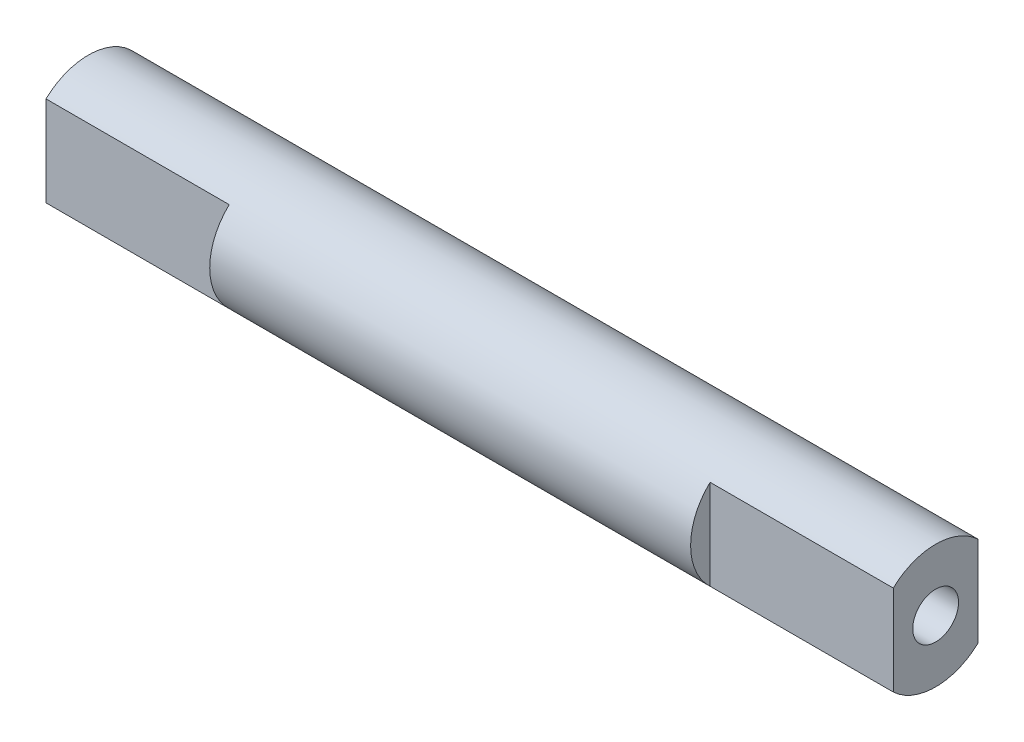
ISO-10303-21;
HEADER;
FILE_DESCRIPTION(('STEP AP214'),'2;1');
FILE_NAME('part.step','',(''),(''),'','','');
FILE_SCHEMA(('AUTOMOTIVE_DESIGN { 1 0 10303 214 1 1 1 1 }'));
ENDSEC;
DATA;
#1=APPLICATION_CONTEXT('core data for automotive mechanical design processes');
#2=APPLICATION_PROTOCOL_DEFINITION('international standard','automotive_design',2000,#1);
#3=PRODUCT_CONTEXT('',#1,'mechanical');
#4=PRODUCT('Part','Part','',(#3));
#5=PRODUCT_RELATED_PRODUCT_CATEGORY('part','',(#4));
#6=PRODUCT_DEFINITION_FORMATION('','',#4);
#7=PRODUCT_DEFINITION_CONTEXT('part definition',#1,'design');
#8=PRODUCT_DEFINITION('design','',#6,#7);
#9=PRODUCT_DEFINITION_SHAPE('','',#8);
#10=(LENGTH_UNIT() NAMED_UNIT(*) SI_UNIT(.MILLI.,.METRE.));
#11=(NAMED_UNIT(*) PLANE_ANGLE_UNIT() SI_UNIT($,.RADIAN.));
#12=(NAMED_UNIT(*) SI_UNIT($,.STERADIAN.) SOLID_ANGLE_UNIT());
#13=UNCERTAINTY_MEASURE_WITH_UNIT(LENGTH_MEASURE(1.E-05),#10,'distance_accuracy_value','');
#14=(GEOMETRIC_REPRESENTATION_CONTEXT(3) GLOBAL_UNCERTAINTY_ASSIGNED_CONTEXT((#13)) GLOBAL_UNIT_ASSIGNED_CONTEXT((#10,
#11,#12)) REPRESENTATION_CONTEXT('',''));
#15=CARTESIAN_POINT('',(0.,0.,0.));
#16=DIRECTION('',(0.,0.,1.));
#17=DIRECTION('',(1.,0.,0.));
#18=AXIS2_PLACEMENT_3D('',#15,#16,#17);
#19=CARTESIAN_POINT('',(18.5,0.,0.));
#20=DIRECTION('',(-1.,0.,0.));
#21=DIRECTION('',(0.,0.,1.));
#22=AXIS2_PLACEMENT_3D('',#19,#20,#21);
#23=CYLINDRICAL_SURFACE('',#22,2.7);
#24=CARTESIAN_POINT('',(18.5,0.,0.));
#25=DIRECTION('',(1.,0.,0.));
#26=DIRECTION('',(0.,0.,-1.));
#27=AXIS2_PLACEMENT_3D('',#24,#25,#26);
#28=CIRCLE('',#27,2.7);
#29=CARTESIAN_POINT('',(18.5,-1.96659604392971,1.85));
#30=VERTEX_POINT('',#29);
#31=CARTESIAN_POINT('',(18.5,-1.96659604392971,-1.85));
#32=VERTEX_POINT('',#31);
#33=EDGE_CURVE('E40',#30,#32,#28,.T.);
#34=ORIENTED_EDGE('',*,*,#33,.F.);
#35=DIRECTION('',(1.,0.,0.));
#36=VECTOR('',#35,1.);
#37=CARTESIAN_POINT('',(10.5,-1.96659604392971,1.85));
#38=LINE('',#37,#36);
#39=CARTESIAN_POINT('',(10.5,-1.96659604392971,1.85));
#40=VERTEX_POINT('',#39);
#41=EDGE_CURVE('E139',#40,#30,#38,.T.);
#42=ORIENTED_EDGE('',*,*,#41,.F.);
#43=CARTESIAN_POINT('',(10.5,0.,0.));
#44=DIRECTION('',(1.,0.,0.));
#45=DIRECTION('',(0.,0.,-1.));
#46=AXIS2_PLACEMENT_3D('',#43,#44,#45);
#47=CIRCLE('',#46,2.7);
#48=CARTESIAN_POINT('',(10.5,1.96659604392971,1.85));
#49=VERTEX_POINT('',#48);
#50=EDGE_CURVE('E133',#49,#40,#47,.T.);
#51=ORIENTED_EDGE('',*,*,#50,.F.);
#52=DIRECTION('',(1.,0.,0.));
#53=VECTOR('',#52,1.);
#54=CARTESIAN_POINT('',(10.5,1.96659604392971,1.85));
#55=LINE('',#54,#53);
#56=CARTESIAN_POINT('',(18.5,1.96659604392971,1.85));
#57=VERTEX_POINT('',#56);
#58=EDGE_CURVE('E142',#49,#57,#55,.T.);
#59=ORIENTED_EDGE('',*,*,#58,.T.);
#60=CARTESIAN_POINT('',(18.5,1.96659604392971,-1.85));
#61=VERTEX_POINT('',#60);
#62=EDGE_CURVE('E11',#61,#57,#28,.T.);
#63=ORIENTED_EDGE('',*,*,#62,.F.);
#64=DIRECTION('',(1.,0.,0.));
#65=VECTOR('',#64,1.);
#66=CARTESIAN_POINT('',(10.5,1.96659604392971,-1.85));
#67=LINE('',#66,#65);
#68=CARTESIAN_POINT('',(10.5,1.96659604392971,-1.85));
#69=VERTEX_POINT('',#68);
#70=EDGE_CURVE('E152',#69,#61,#67,.T.);
#71=ORIENTED_EDGE('',*,*,#70,.F.);
#72=CARTESIAN_POINT('',(10.5,0.,0.));
#73=DIRECTION('',(1.,0.,0.));
#74=DIRECTION('',(0.,0.,-1.));
#75=AXIS2_PLACEMENT_3D('',#72,#73,#74);
#76=CIRCLE('',#75,2.7);
#77=CARTESIAN_POINT('',(10.5,-1.96659604392971,-1.85));
#78=VERTEX_POINT('',#77);
#79=EDGE_CURVE('E147',#78,#69,#76,.T.);
#80=ORIENTED_EDGE('',*,*,#79,.F.);
#81=DIRECTION('',(1.,0.,0.));
#82=VECTOR('',#81,1.);
#83=CARTESIAN_POINT('',(10.5,-1.96659604392971,-1.85));
#84=LINE('',#83,#82);
#85=EDGE_CURVE('E141',#78,#32,#84,.T.);
#86=ORIENTED_EDGE('',*,*,#85,.T.);
#87=EDGE_LOOP('',(#34,#42,#51,#59,#63,#71,#80,#86));
#88=FACE_BOUND('',#87,.T.);
#89=DIRECTION('',(-1.,0.,0.));
#90=VECTOR('',#89,1.);
#91=CARTESIAN_POINT('',(-10.5,1.96659604392971,1.85));
#92=LINE('',#91,#90);
#93=CARTESIAN_POINT('',(-10.5,1.96659604392971,1.85));
#94=VERTEX_POINT('',#93);
#95=CARTESIAN_POINT('',(-18.5,1.96659604392971,1.85));
#96=VERTEX_POINT('',#95);
#97=EDGE_CURVE('E55',#94,#96,#92,.T.);
#98=ORIENTED_EDGE('',*,*,#97,.F.);
#99=CARTESIAN_POINT('',(-10.5,0.,0.));
#100=DIRECTION('',(1.,0.,0.));
#101=DIRECTION('',(0.,0.,-1.));
#102=AXIS2_PLACEMENT_3D('',#99,#100,#101);
#103=CIRCLE('',#102,2.7);
#104=CARTESIAN_POINT('',(-10.5,-1.96659604392971,1.85));
#105=VERTEX_POINT('',#104);
#106=EDGE_CURVE('E102',#94,#105,#103,.T.);
#107=ORIENTED_EDGE('',*,*,#106,.T.);
#108=DIRECTION('',(-1.,0.,0.));
#109=VECTOR('',#108,1.);
#110=CARTESIAN_POINT('',(-10.5,-1.96659604392971,1.85));
#111=LINE('',#110,#109);
#112=CARTESIAN_POINT('',(-18.5,-1.96659604392971,1.85));
#113=VERTEX_POINT('',#112);
#114=EDGE_CURVE('E99',#105,#113,#111,.T.);
#115=ORIENTED_EDGE('',*,*,#114,.T.);
#116=CARTESIAN_POINT('',(-18.5,0.,0.));
#117=DIRECTION('',(1.,0.,0.));
#118=DIRECTION('',(0.,0.,-1.));
#119=AXIS2_PLACEMENT_3D('',#116,#117,#118);
#120=CIRCLE('',#119,2.7);
#121=CARTESIAN_POINT('',(-18.5,-1.96659604392971,-1.85));
#122=VERTEX_POINT('',#121);
#123=EDGE_CURVE('E145',#113,#122,#120,.T.);
#124=ORIENTED_EDGE('',*,*,#123,.T.);
#125=DIRECTION('',(-1.,0.,0.));
#126=VECTOR('',#125,1.);
#127=CARTESIAN_POINT('',(-10.5,-1.96659604392971,-1.85));
#128=LINE('',#127,#126);
#129=CARTESIAN_POINT('',(-10.5,-1.96659604392971,-1.85));
#130=VERTEX_POINT('',#129);
#131=EDGE_CURVE('E47',#130,#122,#128,.T.);
#132=ORIENTED_EDGE('',*,*,#131,.F.);
#133=CARTESIAN_POINT('',(-10.5,0.,0.));
#134=DIRECTION('',(1.,0.,0.));
#135=DIRECTION('',(0.,0.,-1.));
#136=AXIS2_PLACEMENT_3D('',#133,#134,#135);
#137=CIRCLE('',#136,2.7);
#138=CARTESIAN_POINT('',(-10.5,1.96659604392971,-1.85));
#139=VERTEX_POINT('',#138);
#140=EDGE_CURVE('E116',#130,#139,#137,.T.);
#141=ORIENTED_EDGE('',*,*,#140,.T.);
#142=DIRECTION('',(-1.,0.,0.));
#143=VECTOR('',#142,1.);
#144=CARTESIAN_POINT('',(-10.5,1.96659604392971,-1.85));
#145=LINE('',#144,#143);
#146=CARTESIAN_POINT('',(-18.5,1.96659604392971,-1.85));
#147=VERTEX_POINT('',#146);
#148=EDGE_CURVE('E124',#139,#147,#145,.T.);
#149=ORIENTED_EDGE('',*,*,#148,.T.);
#150=EDGE_CURVE('E35',#147,#96,#120,.T.);
#151=ORIENTED_EDGE('',*,*,#150,.T.);
#152=EDGE_LOOP('',(#98,#107,#115,#124,#132,#141,#149,#151));
#153=FACE_BOUND('',#152,.T.);
#154=ADVANCED_FACE('F32',(#88,#153),#23,.T.);
#155=CARTESIAN_POINT('',(-18.5,0.,0.));
#156=DIRECTION('',(1.,0.,0.));
#157=DIRECTION('',(0.,0.,-1.));
#158=AXIS2_PLACEMENT_3D('',#155,#156,#157);
#159=PLANE('',#158);
#160=CARTESIAN_POINT('',(-18.5,0.,0.));
#161=DIRECTION('',(1.,0.,0.));
#162=DIRECTION('',(0.,0.,-1.));
#163=AXIS2_PLACEMENT_3D('',#160,#161,#162);
#164=CIRCLE('',#163,1.);
#165=CARTESIAN_POINT('',(-18.5,0.,-1.));
#166=VERTEX_POINT('',#165);
#167=EDGE_CURVE('E284',#166,#166,#164,.T.);
#168=ORIENTED_EDGE('',*,*,#167,.T.);
#169=EDGE_LOOP('',(#168));
#170=FACE_BOUND('',#169,.T.);
#171=DIRECTION('',(0.,1.,0.));
#172=VECTOR('',#171,1.);
#173=CARTESIAN_POINT('',(-18.5,1.96659604392971,1.85));
#174=LINE('',#173,#172);
#175=EDGE_CURVE('E106',#113,#96,#174,.T.);
#176=ORIENTED_EDGE('',*,*,#175,.T.);
#177=ORIENTED_EDGE('',*,*,#150,.F.);
#178=DIRECTION('',(0.,-1.,0.));
#179=VECTOR('',#178,1.);
#180=CARTESIAN_POINT('',(-18.5,1.96659604392971,-1.85));
#181=LINE('',#180,#179);
#182=EDGE_CURVE('E120',#147,#122,#181,.T.);
#183=ORIENTED_EDGE('',*,*,#182,.T.);
#184=ORIENTED_EDGE('',*,*,#123,.F.);
#185=EDGE_LOOP('',(#176,#177,#183,#184));
#186=FACE_BOUND('',#185,.T.);
#187=ADVANCED_FACE('F189',(#170,#186),#159,.F.);
#188=CARTESIAN_POINT('',(18.5,0.,0.));
#189=DIRECTION('',(1.,0.,0.));
#190=DIRECTION('',(0.,0.,-1.));
#191=AXIS2_PLACEMENT_3D('',#188,#189,#190);
#192=PLANE('',#191);
#193=CARTESIAN_POINT('',(18.5,0.,0.));
#194=DIRECTION('',(1.,0.,0.));
#195=DIRECTION('',(0.,0.,-1.));
#196=AXIS2_PLACEMENT_3D('',#193,#194,#195);
#197=CIRCLE('',#196,1.);
#198=CARTESIAN_POINT('',(18.5,0.,-1.));
#199=VERTEX_POINT('',#198);
#200=EDGE_CURVE('E112',#199,#199,#197,.T.);
#201=ORIENTED_EDGE('',*,*,#200,.F.);
#202=EDGE_LOOP('',(#201));
#203=FACE_BOUND('',#202,.T.);
#204=DIRECTION('',(0.,1.,0.));
#205=VECTOR('',#204,1.);
#206=CARTESIAN_POINT('',(18.5,1.96659604392971,1.85));
#207=LINE('',#206,#205);
#208=EDGE_CURVE('E136',#30,#57,#207,.T.);
#209=ORIENTED_EDGE('',*,*,#208,.F.);
#210=ORIENTED_EDGE('',*,*,#33,.T.);
#211=DIRECTION('',(0.,-1.,0.));
#212=VECTOR('',#211,1.);
#213=CARTESIAN_POINT('',(18.5,1.96659604392971,-1.85));
#214=LINE('',#213,#212);
#215=EDGE_CURVE('E130',#61,#32,#214,.T.);
#216=ORIENTED_EDGE('',*,*,#215,.F.);
#217=ORIENTED_EDGE('',*,*,#62,.T.);
#218=EDGE_LOOP('',(#209,#210,#216,#217));
#219=FACE_BOUND('',#218,.T.);
#220=ADVANCED_FACE('F167',(#203,#219),#192,.T.);
#221=CARTESIAN_POINT('',(10.5,1.96659604392971,-1.85));
#222=DIRECTION('',(0.,0.,1.));
#223=DIRECTION('',(1.,0.,0.));
#224=AXIS2_PLACEMENT_3D('',#221,#222,#223);
#225=PLANE('',#224);
#226=ORIENTED_EDGE('',*,*,#215,.T.);
#227=ORIENTED_EDGE('',*,*,#85,.F.);
#228=DIRECTION('',(0.,-1.,0.));
#229=VECTOR('',#228,1.);
#230=CARTESIAN_POINT('',(10.5,1.96659604392971,-1.85));
#231=LINE('',#230,#229);
#232=EDGE_CURVE('E149',#69,#78,#231,.T.);
#233=ORIENTED_EDGE('',*,*,#232,.F.);
#234=ORIENTED_EDGE('',*,*,#70,.T.);
#235=EDGE_LOOP('',(#226,#227,#233,#234));
#236=FACE_BOUND('',#235,.T.);
#237=ADVANCED_FACE('F160',(#236),#225,.F.);
#238=CARTESIAN_POINT('',(10.5,0.,0.));
#239=DIRECTION('',(1.,0.,0.));
#240=DIRECTION('',(0.,0.,-1.));
#241=AXIS2_PLACEMENT_3D('',#238,#239,#240);
#242=PLANE('',#241);
#243=ORIENTED_EDGE('',*,*,#79,.T.);
#244=ORIENTED_EDGE('',*,*,#232,.T.);
#245=EDGE_LOOP('',(#243,#244));
#246=FACE_BOUND('',#245,.T.);
#247=ADVANCED_FACE('F186',(#246),#242,.T.);
#248=CARTESIAN_POINT('',(10.5,1.96659604392971,1.85));
#249=DIRECTION('',(0.,0.,-1.));
#250=DIRECTION('',(-1.,0.,0.));
#251=AXIS2_PLACEMENT_3D('',#248,#249,#250);
#252=PLANE('',#251);
#253=ORIENTED_EDGE('',*,*,#208,.T.);
#254=ORIENTED_EDGE('',*,*,#58,.F.);
#255=DIRECTION('',(0.,1.,0.));
#256=VECTOR('',#255,1.);
#257=CARTESIAN_POINT('',(10.5,1.96659604392971,1.85));
#258=LINE('',#257,#256);
#259=EDGE_CURVE('E135',#40,#49,#258,.T.);
#260=ORIENTED_EDGE('',*,*,#259,.F.);
#261=ORIENTED_EDGE('',*,*,#41,.T.);
#262=EDGE_LOOP('',(#253,#254,#260,#261));
#263=FACE_BOUND('',#262,.T.);
#264=ADVANCED_FACE('F173',(#263),#252,.F.);
#265=CARTESIAN_POINT('',(10.5,0.,0.));
#266=DIRECTION('',(1.,0.,0.));
#267=DIRECTION('',(0.,0.,-1.));
#268=AXIS2_PLACEMENT_3D('',#265,#266,#267);
#269=PLANE('',#268);
#270=ORIENTED_EDGE('',*,*,#50,.T.);
#271=ORIENTED_EDGE('',*,*,#259,.T.);
#272=EDGE_LOOP('',(#270,#271));
#273=FACE_BOUND('',#272,.T.);
#274=ADVANCED_FACE('F175',(#273),#269,.T.);
#275=CARTESIAN_POINT('',(12.5,0.,0.));
#276=DIRECTION('',(1.,0.,0.));
#277=DIRECTION('',(0.,0.,-1.));
#278=AXIS2_PLACEMENT_3D('',#275,#276,#277);
#279=CYLINDRICAL_SURFACE('',#278,1.);
#280=CARTESIAN_POINT('',(12.5,0.,0.));
#281=DIRECTION('',(1.,0.,0.));
#282=DIRECTION('',(0.,0.,-1.));
#283=AXIS2_PLACEMENT_3D('',#280,#281,#282);
#284=CIRCLE('',#283,1.);
#285=CARTESIAN_POINT('',(12.5,0.,-1.));
#286=VERTEX_POINT('',#285);
#287=EDGE_CURVE('E127',#286,#286,#284,.T.);
#288=ORIENTED_EDGE('',*,*,#287,.F.);
#289=EDGE_LOOP('',(#288));
#290=FACE_BOUND('',#289,.T.);
#291=ORIENTED_EDGE('',*,*,#200,.T.);
#292=EDGE_LOOP('',(#291));
#293=FACE_BOUND('',#292,.T.);
#294=ADVANCED_FACE('F177',(#290,#293),#279,.F.);
#295=CARTESIAN_POINT('',(12.5,0.,0.));
#296=DIRECTION('',(1.,0.,0.));
#297=DIRECTION('',(0.,0.,-1.));
#298=AXIS2_PLACEMENT_3D('',#295,#296,#297);
#299=PLANE('',#298);
#300=ORIENTED_EDGE('',*,*,#287,.T.);
#301=EDGE_LOOP('',(#300));
#302=FACE_BOUND('',#301,.T.);
#303=ADVANCED_FACE('F183',(#302),#299,.T.);
#304=CARTESIAN_POINT('',(-10.5,1.96659604392971,-1.85));
#305=DIRECTION('',(0.,0.,-1.));
#306=DIRECTION('',(-1.,0.,0.));
#307=AXIS2_PLACEMENT_3D('',#304,#305,#306);
#308=PLANE('',#307);
#309=ORIENTED_EDGE('',*,*,#182,.F.);
#310=ORIENTED_EDGE('',*,*,#148,.F.);
#311=DIRECTION('',(0.,-1.,0.));
#312=VECTOR('',#311,1.);
#313=CARTESIAN_POINT('',(-10.5,1.96659604392971,-1.85));
#314=LINE('',#313,#312);
#315=EDGE_CURVE('E119',#139,#130,#314,.T.);
#316=ORIENTED_EDGE('',*,*,#315,.T.);
#317=ORIENTED_EDGE('',*,*,#131,.T.);
#318=EDGE_LOOP('',(#309,#310,#316,#317));
#319=FACE_BOUND('',#318,.T.);
#320=ADVANCED_FACE('F211',(#319),#308,.T.);
#321=CARTESIAN_POINT('',(-10.5,0.,0.));
#322=DIRECTION('',(-1.,0.,0.));
#323=DIRECTION('',(0.,0.,-1.));
#324=AXIS2_PLACEMENT_3D('',#321,#322,#323);
#325=PLANE('',#324);
#326=ORIENTED_EDGE('',*,*,#140,.F.);
#327=ORIENTED_EDGE('',*,*,#315,.F.);
#328=EDGE_LOOP('',(#326,#327));
#329=FACE_BOUND('',#328,.T.);
#330=ADVANCED_FACE('F214',(#329),#325,.T.);
#331=CARTESIAN_POINT('',(-10.5,1.96659604392971,1.85));
#332=DIRECTION('',(0.,0.,1.));
#333=DIRECTION('',(1.,0.,0.));
#334=AXIS2_PLACEMENT_3D('',#331,#332,#333);
#335=PLANE('',#334);
#336=ORIENTED_EDGE('',*,*,#175,.F.);
#337=ORIENTED_EDGE('',*,*,#114,.F.);
#338=DIRECTION('',(0.,1.,0.));
#339=VECTOR('',#338,1.);
#340=CARTESIAN_POINT('',(-10.5,1.96659604392971,1.85));
#341=LINE('',#340,#339);
#342=EDGE_CURVE('E95',#105,#94,#341,.T.);
#343=ORIENTED_EDGE('',*,*,#342,.T.);
#344=ORIENTED_EDGE('',*,*,#97,.T.);
#345=EDGE_LOOP('',(#336,#337,#343,#344));
#346=FACE_BOUND('',#345,.T.);
#347=ADVANCED_FACE('F97',(#346),#335,.T.);
#348=CARTESIAN_POINT('',(-10.5,0.,0.));
#349=DIRECTION('',(-1.,0.,0.));
#350=DIRECTION('',(0.,0.,-1.));
#351=AXIS2_PLACEMENT_3D('',#348,#349,#350);
#352=PLANE('',#351);
#353=ORIENTED_EDGE('',*,*,#106,.F.);
#354=ORIENTED_EDGE('',*,*,#342,.F.);
#355=EDGE_LOOP('',(#353,#354));
#356=FACE_BOUND('',#355,.T.);
#357=ADVANCED_FACE('F104',(#356),#352,.T.);
#358=CARTESIAN_POINT('',(-12.5,0.,0.));
#359=DIRECTION('',(-1.,0.,0.));
#360=DIRECTION('',(0.,0.,1.));
#361=AXIS2_PLACEMENT_3D('',#358,#359,#360);
#362=CYLINDRICAL_SURFACE('',#361,1.);
#363=CARTESIAN_POINT('',(-12.5,0.,0.));
#364=DIRECTION('',(1.,0.,0.));
#365=DIRECTION('',(0.,0.,-1.));
#366=AXIS2_PLACEMENT_3D('',#363,#364,#365);
#367=CIRCLE('',#366,1.);
#368=CARTESIAN_POINT('',(-12.5,0.,-1.));
#369=VERTEX_POINT('',#368);
#370=EDGE_CURVE('E123',#369,#369,#367,.T.);
#371=ORIENTED_EDGE('',*,*,#370,.T.);
#372=EDGE_LOOP('',(#371));
#373=FACE_BOUND('',#372,.T.);
#374=ORIENTED_EDGE('',*,*,#167,.F.);
#375=EDGE_LOOP('',(#374));
#376=FACE_BOUND('',#375,.T.);
#377=ADVANCED_FACE('F260',(#373,#376),#362,.F.);
#378=CARTESIAN_POINT('',(-12.5,0.,0.));
#379=DIRECTION('',(-1.,0.,0.));
#380=DIRECTION('',(0.,0.,-1.));
#381=AXIS2_PLACEMENT_3D('',#378,#379,#380);
#382=PLANE('',#381);
#383=ORIENTED_EDGE('',*,*,#370,.F.);
#384=EDGE_LOOP('',(#383));
#385=FACE_BOUND('',#384,.T.);
#386=ADVANCED_FACE('F268',(#385),#382,.T.);
#387=CLOSED_SHELL('',(#154,#187,#220,#237,#247,#264,#274,#294,#303,#320,#330,#347,#357,#377,#386));
#388=MANIFOLD_SOLID_BREP('B2',#387);
#389=ADVANCED_BREP_SHAPE_REPRESENTATION('',(#18,#388),#14);
#390=SHAPE_DEFINITION_REPRESENTATION(#9,#389);
ENDSEC;
END-ISO-10303-21;
